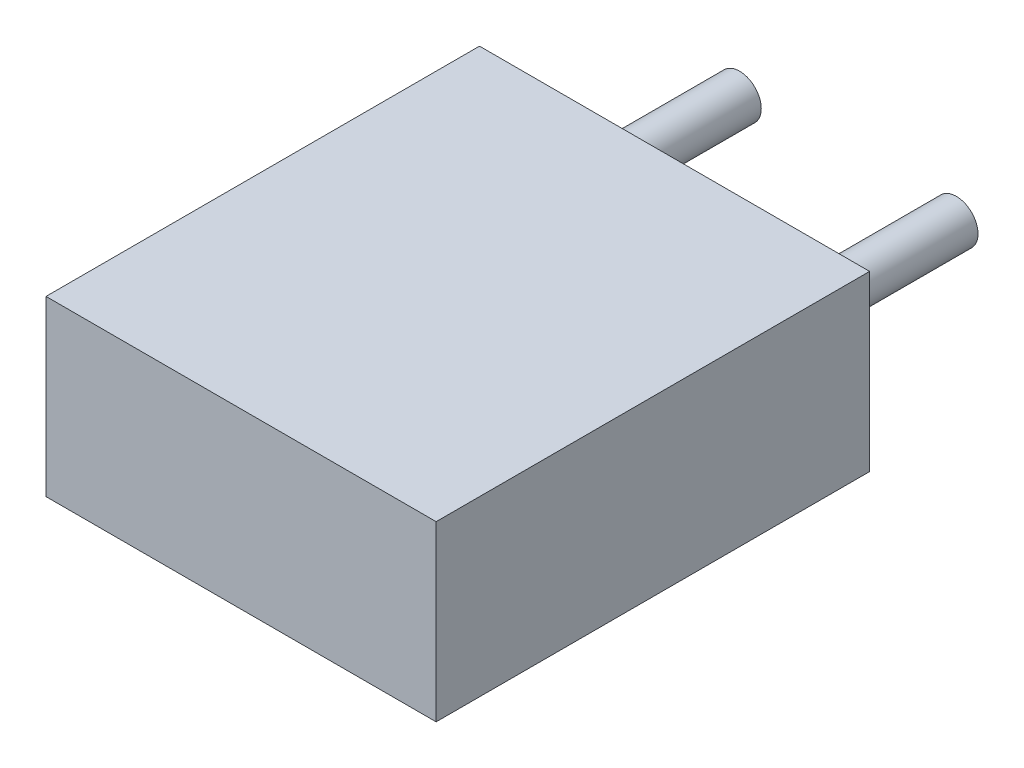
ISO-10303-21;
HEADER;
FILE_DESCRIPTION(('STEP AP214'),'2;1');
FILE_NAME('part.step','',(''),(''),'','','');
FILE_SCHEMA(('AUTOMOTIVE_DESIGN { 1 0 10303 214 1 1 1 1 }'));
ENDSEC;
DATA;
#1=APPLICATION_CONTEXT('core data for automotive mechanical design processes');
#2=APPLICATION_PROTOCOL_DEFINITION('international standard','automotive_design',2000,#1);
#3=PRODUCT_CONTEXT('',#1,'mechanical');
#4=PRODUCT('Part','Part','',(#3));
#5=PRODUCT_RELATED_PRODUCT_CATEGORY('part','',(#4));
#6=PRODUCT_DEFINITION_FORMATION('','',#4);
#7=PRODUCT_DEFINITION_CONTEXT('part definition',#1,'design');
#8=PRODUCT_DEFINITION('design','',#6,#7);
#9=PRODUCT_DEFINITION_SHAPE('','',#8);
#10=(LENGTH_UNIT() NAMED_UNIT(*) SI_UNIT(.MILLI.,.METRE.));
#11=(NAMED_UNIT(*) PLANE_ANGLE_UNIT() SI_UNIT($,.RADIAN.));
#12=(NAMED_UNIT(*) SI_UNIT($,.STERADIAN.) SOLID_ANGLE_UNIT());
#13=UNCERTAINTY_MEASURE_WITH_UNIT(LENGTH_MEASURE(1.E-05),#10,'distance_accuracy_value','');
#14=(GEOMETRIC_REPRESENTATION_CONTEXT(3) GLOBAL_UNCERTAINTY_ASSIGNED_CONTEXT((#13)) GLOBAL_UNIT_ASSIGNED_CONTEXT((#10,
#11,#12)) REPRESENTATION_CONTEXT('',''));
#15=CARTESIAN_POINT('',(0.,0.,0.));
#16=DIRECTION('',(0.,0.,1.));
#17=DIRECTION('',(1.,0.,0.));
#18=AXIS2_PLACEMENT_3D('',#15,#16,#17);
#19=CARTESIAN_POINT('',(2.5,0.,-2.));
#20=DIRECTION('',(0.,0.,1.));
#21=DIRECTION('',(1.,0.,0.));
#22=AXIS2_PLACEMENT_3D('',#19,#20,#21);
#23=CYLINDRICAL_SURFACE('',#22,0.25);
#24=CARTESIAN_POINT('',(2.5,0.,-2.));
#25=DIRECTION('',(0.,0.,1.));
#26=DIRECTION('',(1.,0.,0.));
#27=AXIS2_PLACEMENT_3D('',#24,#25,#26);
#28=CIRCLE('',#27,0.25);
#29=CARTESIAN_POINT('',(2.75,0.,-2.));
#30=VERTEX_POINT('',#29);
#31=EDGE_CURVE('E11',#30,#30,#28,.T.);
#32=ORIENTED_EDGE('',*,*,#31,.T.);
#33=EDGE_LOOP('',(#32));
#34=FACE_BOUND('',#33,.T.);
#35=CARTESIAN_POINT('',(2.5,0.,0.));
#36=DIRECTION('',(0.,0.,1.));
#37=DIRECTION('',(1.,0.,0.));
#38=AXIS2_PLACEMENT_3D('',#35,#36,#37);
#39=CIRCLE('',#38,0.25);
#40=CARTESIAN_POINT('',(2.75,0.,0.));
#41=VERTEX_POINT('',#40);
#42=EDGE_CURVE('E43',#41,#41,#39,.T.);
#43=ORIENTED_EDGE('',*,*,#42,.F.);
#44=EDGE_LOOP('',(#43));
#45=FACE_BOUND('',#44,.T.);
#46=ADVANCED_FACE('F40',(#34,#45),#23,.T.);
#47=CARTESIAN_POINT('',(2.5,0.,-2.));
#48=DIRECTION('',(0.,0.,1.));
#49=DIRECTION('',(1.,0.,0.));
#50=AXIS2_PLACEMENT_3D('',#47,#48,#49);
#51=PLANE('',#50);
#52=ORIENTED_EDGE('',*,*,#31,.F.);
#53=EDGE_LOOP('',(#52));
#54=FACE_BOUND('',#53,.T.);
#55=ADVANCED_FACE('F55',(#54),#51,.F.);
#56=CARTESIAN_POINT('',(2.5,0.,0.));
#57=DIRECTION('',(0.,0.,1.));
#58=DIRECTION('',(1.,0.,0.));
#59=AXIS2_PLACEMENT_3D('',#56,#57,#58);
#60=PLANE('',#59);
#61=ORIENTED_EDGE('',*,*,#42,.T.);
#62=EDGE_LOOP('',(#61));
#63=FACE_BOUND('',#62,.T.);
#64=ADVANCED_FACE('F52',(#63),#60,.T.);
#65=CLOSED_SHELL('',(#46,#55,#64));
#66=MANIFOLD_SOLID_BREP('B2',#65);
#67=CARTESIAN_POINT('',(0.,0.,-2.));
#68=DIRECTION('',(0.,0.,1.));
#69=DIRECTION('',(1.,0.,0.));
#70=AXIS2_PLACEMENT_3D('',#67,#68,#69);
#71=CYLINDRICAL_SURFACE('',#70,0.25);
#72=CARTESIAN_POINT('',(0.,0.,-2.));
#73=DIRECTION('',(0.,0.,1.));
#74=DIRECTION('',(1.,0.,0.));
#75=AXIS2_PLACEMENT_3D('',#72,#73,#74);
#76=CIRCLE('',#75,0.25);
#77=CARTESIAN_POINT('',(0.25,0.,-2.));
#78=VERTEX_POINT('',#77);
#79=EDGE_CURVE('E39',#78,#78,#76,.T.);
#80=ORIENTED_EDGE('',*,*,#79,.T.);
#81=EDGE_LOOP('',(#80));
#82=FACE_BOUND('',#81,.T.);
#83=CARTESIAN_POINT('',(0.,0.,0.));
#84=DIRECTION('',(0.,0.,1.));
#85=DIRECTION('',(1.,0.,0.));
#86=AXIS2_PLACEMENT_3D('',#83,#84,#85);
#87=CIRCLE('',#86,0.25);
#88=CARTESIAN_POINT('',(0.25,0.,0.));
#89=VERTEX_POINT('',#88);
#90=EDGE_CURVE('E93',#89,#89,#87,.T.);
#91=ORIENTED_EDGE('',*,*,#90,.F.);
#92=EDGE_LOOP('',(#91));
#93=FACE_BOUND('',#92,.T.);
#94=ADVANCED_FACE('F90',(#82,#93),#71,.T.);
#95=CARTESIAN_POINT('',(0.,0.,-2.));
#96=DIRECTION('',(0.,0.,1.));
#97=DIRECTION('',(1.,0.,0.));
#98=AXIS2_PLACEMENT_3D('',#95,#96,#97);
#99=PLANE('',#98);
#100=ORIENTED_EDGE('',*,*,#79,.F.);
#101=EDGE_LOOP('',(#100));
#102=FACE_BOUND('',#101,.T.);
#103=ADVANCED_FACE('F105',(#102),#99,.F.);
#104=CARTESIAN_POINT('',(0.,0.,0.));
#105=DIRECTION('',(0.,0.,1.));
#106=DIRECTION('',(1.,0.,0.));
#107=AXIS2_PLACEMENT_3D('',#104,#105,#106);
#108=PLANE('',#107);
#109=ORIENTED_EDGE('',*,*,#90,.T.);
#110=EDGE_LOOP('',(#109));
#111=FACE_BOUND('',#110,.T.);
#112=ADVANCED_FACE('F102',(#111),#108,.T.);
#113=CLOSED_SHELL('',(#94,#103,#112));
#114=MANIFOLD_SOLID_BREP('B6',#113);
#115=CARTESIAN_POINT('',(3.5,1.,5.));
#116=DIRECTION('',(0.,-1.,0.));
#117=DIRECTION('',(0.,0.,-1.));
#118=AXIS2_PLACEMENT_3D('',#115,#116,#117);
#119=PLANE('',#118);
#120=DIRECTION('',(-1.,0.,0.));
#121=VECTOR('',#120,1.);
#122=CARTESIAN_POINT('',(3.5,1.,0.));
#123=LINE('',#122,#121);
#124=CARTESIAN_POINT('',(3.5,1.,0.));
#125=VERTEX_POINT('',#124);
#126=CARTESIAN_POINT('',(-1.,1.,0.));
#127=VERTEX_POINT('',#126);
#128=EDGE_CURVE('E194',#125,#127,#123,.T.);
#129=ORIENTED_EDGE('',*,*,#128,.T.);
#130=DIRECTION('',(0.,0.,-1.));
#131=VECTOR('',#130,1.);
#132=CARTESIAN_POINT('',(-1.,1.,5.));
#133=LINE('',#132,#131);
#134=CARTESIAN_POINT('',(-1.,1.,5.));
#135=VERTEX_POINT('',#134);
#136=EDGE_CURVE('E88',#135,#127,#133,.T.);
#137=ORIENTED_EDGE('',*,*,#136,.F.);
#138=DIRECTION('',(-1.,0.,0.));
#139=VECTOR('',#138,1.);
#140=CARTESIAN_POINT('',(3.5,1.,5.));
#141=LINE('',#140,#139);
#142=CARTESIAN_POINT('',(3.5,1.,5.));
#143=VERTEX_POINT('',#142);
#144=EDGE_CURVE('E182',#143,#135,#141,.T.);
#145=ORIENTED_EDGE('',*,*,#144,.F.);
#146=DIRECTION('',(0.,0.,-1.));
#147=VECTOR('',#146,1.);
#148=CARTESIAN_POINT('',(3.5,1.,5.));
#149=LINE('',#148,#147);
#150=EDGE_CURVE('E190',#143,#125,#149,.T.);
#151=ORIENTED_EDGE('',*,*,#150,.T.);
#152=EDGE_LOOP('',(#129,#137,#145,#151));
#153=FACE_BOUND('',#152,.T.);
#154=ADVANCED_FACE('F131',(#153),#119,.F.);
#155=CARTESIAN_POINT('',(-1.,1.,5.));
#156=DIRECTION('',(1.,0.,0.));
#157=DIRECTION('',(0.,0.,-1.));
#158=AXIS2_PLACEMENT_3D('',#155,#156,#157);
#159=PLANE('',#158);
#160=DIRECTION('',(0.,-1.,0.));
#161=VECTOR('',#160,1.);
#162=CARTESIAN_POINT('',(-1.,1.,0.));
#163=LINE('',#162,#161);
#164=CARTESIAN_POINT('',(-1.,-1.,0.));
#165=VERTEX_POINT('',#164);
#166=EDGE_CURVE('E186',#127,#165,#163,.T.);
#167=ORIENTED_EDGE('',*,*,#166,.T.);
#168=DIRECTION('',(0.,0.,-1.));
#169=VECTOR('',#168,1.);
#170=CARTESIAN_POINT('',(-1.,-1.,5.));
#171=LINE('',#170,#169);
#172=CARTESIAN_POINT('',(-1.,-1.,5.));
#173=VERTEX_POINT('',#172);
#174=EDGE_CURVE('E139',#173,#165,#171,.T.);
#175=ORIENTED_EDGE('',*,*,#174,.F.);
#176=DIRECTION('',(0.,-1.,0.));
#177=VECTOR('',#176,1.);
#178=CARTESIAN_POINT('',(-1.,1.,5.));
#179=LINE('',#178,#177);
#180=EDGE_CURVE('E177',#135,#173,#179,.T.);
#181=ORIENTED_EDGE('',*,*,#180,.F.);
#182=ORIENTED_EDGE('',*,*,#136,.T.);
#183=EDGE_LOOP('',(#167,#175,#181,#182));
#184=FACE_BOUND('',#183,.T.);
#185=ADVANCED_FACE('F185',(#184),#159,.F.);
#186=CARTESIAN_POINT('',(-1.,-1.,5.));
#187=DIRECTION('',(0.,1.,0.));
#188=DIRECTION('',(0.,0.,1.));
#189=AXIS2_PLACEMENT_3D('',#186,#187,#188);
#190=PLANE('',#189);
#191=DIRECTION('',(1.,0.,0.));
#192=VECTOR('',#191,1.);
#193=CARTESIAN_POINT('',(-1.,-1.,0.));
#194=LINE('',#193,#192);
#195=CARTESIAN_POINT('',(3.5,-1.,0.));
#196=VERTEX_POINT('',#195);
#197=EDGE_CURVE('E164',#165,#196,#194,.T.);
#198=ORIENTED_EDGE('',*,*,#197,.T.);
#199=DIRECTION('',(0.,0.,-1.));
#200=VECTOR('',#199,1.);
#201=CARTESIAN_POINT('',(3.5,-1.,5.));
#202=LINE('',#201,#200);
#203=CARTESIAN_POINT('',(3.5,-1.,5.));
#204=VERTEX_POINT('',#203);
#205=EDGE_CURVE('E187',#204,#196,#202,.T.);
#206=ORIENTED_EDGE('',*,*,#205,.F.);
#207=DIRECTION('',(1.,0.,0.));
#208=VECTOR('',#207,1.);
#209=CARTESIAN_POINT('',(-1.,-1.,5.));
#210=LINE('',#209,#208);
#211=EDGE_CURVE('E180',#173,#204,#210,.T.);
#212=ORIENTED_EDGE('',*,*,#211,.F.);
#213=ORIENTED_EDGE('',*,*,#174,.T.);
#214=EDGE_LOOP('',(#198,#206,#212,#213));
#215=FACE_BOUND('',#214,.T.);
#216=ADVANCED_FACE('F188',(#215),#190,.F.);
#217=CARTESIAN_POINT('',(3.5,-1.,5.));
#218=DIRECTION('',(-1.,0.,0.));
#219=DIRECTION('',(0.,0.,1.));
#220=AXIS2_PLACEMENT_3D('',#217,#218,#219);
#221=PLANE('',#220);
#222=DIRECTION('',(0.,1.,0.));
#223=VECTOR('',#222,1.);
#224=CARTESIAN_POINT('',(3.5,-1.,0.));
#225=LINE('',#224,#223);
#226=EDGE_CURVE('E170',#196,#125,#225,.T.);
#227=ORIENTED_EDGE('',*,*,#226,.T.);
#228=ORIENTED_EDGE('',*,*,#150,.F.);
#229=DIRECTION('',(0.,1.,0.));
#230=VECTOR('',#229,1.);
#231=CARTESIAN_POINT('',(3.5,-1.,5.));
#232=LINE('',#231,#230);
#233=EDGE_CURVE('E147',#204,#143,#232,.T.);
#234=ORIENTED_EDGE('',*,*,#233,.F.);
#235=ORIENTED_EDGE('',*,*,#205,.T.);
#236=EDGE_LOOP('',(#227,#228,#234,#235));
#237=FACE_BOUND('',#236,.T.);
#238=ADVANCED_FACE('F201',(#237),#221,.F.);
#239=CARTESIAN_POINT('',(0.,0.,5.));
#240=DIRECTION('',(0.,0.,1.));
#241=DIRECTION('',(1.,0.,0.));
#242=AXIS2_PLACEMENT_3D('',#239,#240,#241);
#243=PLANE('',#242);
#244=ORIENTED_EDGE('',*,*,#144,.T.);
#245=ORIENTED_EDGE('',*,*,#180,.T.);
#246=ORIENTED_EDGE('',*,*,#211,.T.);
#247=ORIENTED_EDGE('',*,*,#233,.T.);
#248=EDGE_LOOP('',(#244,#245,#246,#247));
#249=FACE_BOUND('',#248,.T.);
#250=ADVANCED_FACE('F178',(#249),#243,.T.);
#251=CARTESIAN_POINT('',(0.,0.,0.));
#252=DIRECTION('',(0.,0.,1.));
#253=DIRECTION('',(1.,0.,0.));
#254=AXIS2_PLACEMENT_3D('',#251,#252,#253);
#255=PLANE('',#254);
#256=ORIENTED_EDGE('',*,*,#128,.F.);
#257=ORIENTED_EDGE('',*,*,#226,.F.);
#258=ORIENTED_EDGE('',*,*,#197,.F.);
#259=ORIENTED_EDGE('',*,*,#166,.F.);
#260=EDGE_LOOP('',(#256,#257,#258,#259));
#261=FACE_BOUND('',#260,.T.);
#262=ADVANCED_FACE('F204',(#261),#255,.F.);
#263=CLOSED_SHELL('',(#154,#185,#216,#238,#250,#262));
#264=MANIFOLD_SOLID_BREP('B34',#263);
#265=ADVANCED_BREP_SHAPE_REPRESENTATION('',(#18,#66,#114,#264),#14);
#266=SHAPE_DEFINITION_REPRESENTATION(#9,#265);
ENDSEC;
END-ISO-10303-21;
